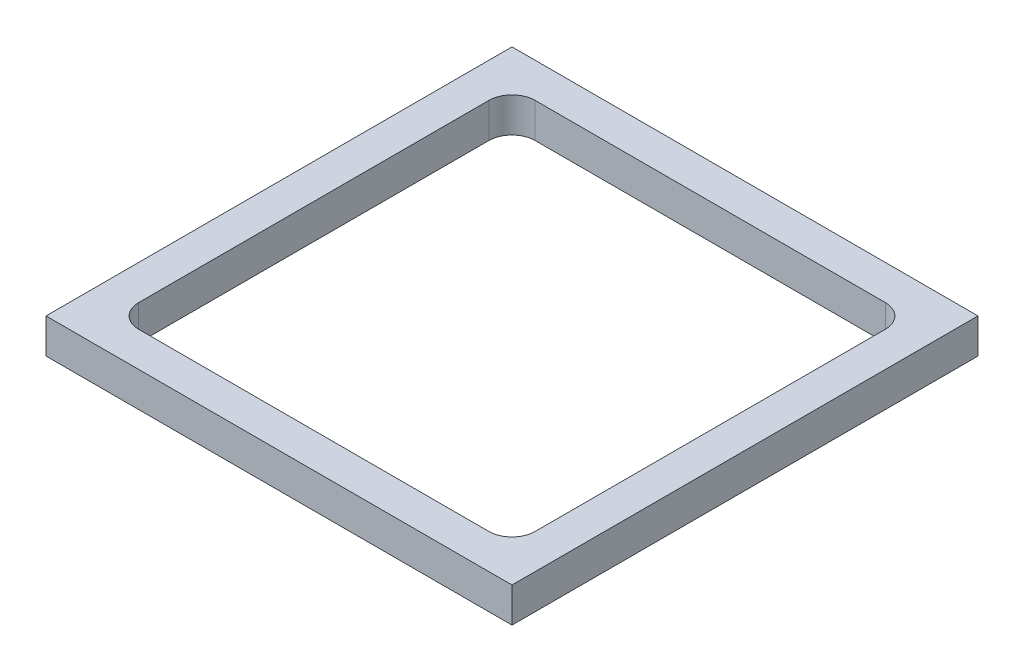
ISO-10303-21;
HEADER;
FILE_DESCRIPTION(('STEP AP214'),'2;1');
FILE_NAME('part.step','',(''),(''),'','','');
FILE_SCHEMA(('AUTOMOTIVE_DESIGN { 1 0 10303 214 1 1 1 1 }'));
ENDSEC;
DATA;
#1=APPLICATION_CONTEXT('core data for automotive mechanical design processes');
#2=APPLICATION_PROTOCOL_DEFINITION('international standard','automotive_design',2000,#1);
#3=PRODUCT_CONTEXT('',#1,'mechanical');
#4=PRODUCT('Part','Part','',(#3));
#5=PRODUCT_RELATED_PRODUCT_CATEGORY('part','',(#4));
#6=PRODUCT_DEFINITION_FORMATION('','',#4);
#7=PRODUCT_DEFINITION_CONTEXT('part definition',#1,'design');
#8=PRODUCT_DEFINITION('design','',#6,#7);
#9=PRODUCT_DEFINITION_SHAPE('','',#8);
#10=(LENGTH_UNIT() NAMED_UNIT(*) SI_UNIT(.MILLI.,.METRE.));
#11=(NAMED_UNIT(*) PLANE_ANGLE_UNIT() SI_UNIT($,.RADIAN.));
#12=(NAMED_UNIT(*) SI_UNIT($,.STERADIAN.) SOLID_ANGLE_UNIT());
#13=UNCERTAINTY_MEASURE_WITH_UNIT(LENGTH_MEASURE(1.E-05),#10,'distance_accuracy_value','');
#14=(GEOMETRIC_REPRESENTATION_CONTEXT(3) GLOBAL_UNCERTAINTY_ASSIGNED_CONTEXT((#13)) GLOBAL_UNIT_ASSIGNED_CONTEXT((#10,
#11,#12)) REPRESENTATION_CONTEXT('',''));
#15=CARTESIAN_POINT('',(0.,0.,0.));
#16=DIRECTION('',(0.,0.,1.));
#17=DIRECTION('',(1.,0.,0.));
#18=AXIS2_PLACEMENT_3D('',#15,#16,#17);
#19=CARTESIAN_POINT('',(0.,9.525,0.));
#20=DIRECTION('',(-1.,0.,0.));
#21=DIRECTION('',(0.,0.,1.));
#22=AXIS2_PLACEMENT_3D('',#19,#20,#21);
#23=PLANE('',#22);
#24=DIRECTION('',(0.,0.,-1.));
#25=VECTOR('',#24,1.);
#26=CARTESIAN_POINT('',(0.,0.,0.));
#27=LINE('',#26,#25);
#28=CARTESIAN_POINT('',(0.,0.,0.));
#29=VERTEX_POINT('',#28);
#30=CARTESIAN_POINT('',(0.,0.,-127.635));
#31=VERTEX_POINT('',#30);
#32=EDGE_CURVE('E160',#29,#31,#27,.T.);
#33=ORIENTED_EDGE('',*,*,#32,.F.);
#34=DIRECTION('',(0.,-1.,0.));
#35=VECTOR('',#34,1.);
#36=CARTESIAN_POINT('',(0.,9.525,0.));
#37=LINE('',#36,#35);
#38=CARTESIAN_POINT('',(0.,9.525,0.));
#39=VERTEX_POINT('',#38);
#40=EDGE_CURVE('E148',#39,#29,#37,.T.);
#41=ORIENTED_EDGE('',*,*,#40,.F.);
#42=DIRECTION('',(0.,0.,-1.));
#43=VECTOR('',#42,1.);
#44=CARTESIAN_POINT('',(0.,9.525,0.));
#45=LINE('',#44,#43);
#46=CARTESIAN_POINT('',(0.,9.525,-127.635));
#47=VERTEX_POINT('',#46);
#48=EDGE_CURVE('E143',#39,#47,#45,.T.);
#49=ORIENTED_EDGE('',*,*,#48,.T.);
#50=DIRECTION('',(0.,-1.,0.));
#51=VECTOR('',#50,1.);
#52=CARTESIAN_POINT('',(0.,9.525,-127.635));
#53=LINE('',#52,#51);
#54=EDGE_CURVE('E127',#47,#31,#53,.T.);
#55=ORIENTED_EDGE('',*,*,#54,.T.);
#56=EDGE_LOOP('',(#33,#41,#49,#55));
#57=FACE_BOUND('',#56,.T.);
#58=ADVANCED_FACE('F37',(#57),#23,.T.);
#59=CARTESIAN_POINT('',(0.,9.525,0.));
#60=DIRECTION('',(0.,0.,-1.));
#61=DIRECTION('',(-1.,0.,0.));
#62=AXIS2_PLACEMENT_3D('',#59,#60,#61);
#63=PLANE('',#62);
#64=DIRECTION('',(1.,0.,0.));
#65=VECTOR('',#64,1.);
#66=CARTESIAN_POINT('',(0.,0.,0.));
#67=LINE('',#66,#65);
#68=CARTESIAN_POINT('',(127.635,0.,0.));
#69=VERTEX_POINT('',#68);
#70=EDGE_CURVE('E150',#29,#69,#67,.T.);
#71=ORIENTED_EDGE('',*,*,#70,.T.);
#72=DIRECTION('',(0.,-1.,0.));
#73=VECTOR('',#72,1.);
#74=CARTESIAN_POINT('',(127.635,9.525,0.));
#75=LINE('',#74,#73);
#76=CARTESIAN_POINT('',(127.635,9.525,0.));
#77=VERTEX_POINT('',#76);
#78=EDGE_CURVE('E168',#77,#69,#75,.T.);
#79=ORIENTED_EDGE('',*,*,#78,.F.);
#80=DIRECTION('',(1.,0.,0.));
#81=VECTOR('',#80,1.);
#82=CARTESIAN_POINT('',(0.,9.525,0.));
#83=LINE('',#82,#81);
#84=EDGE_CURVE('E138',#39,#77,#83,.T.);
#85=ORIENTED_EDGE('',*,*,#84,.F.);
#86=ORIENTED_EDGE('',*,*,#40,.T.);
#87=EDGE_LOOP('',(#71,#79,#85,#86));
#88=FACE_BOUND('',#87,.T.);
#89=ADVANCED_FACE('F251',(#88),#63,.F.);
#90=CARTESIAN_POINT('',(127.635,9.525,0.));
#91=DIRECTION('',(-1.,0.,0.));
#92=DIRECTION('',(0.,0.,1.));
#93=AXIS2_PLACEMENT_3D('',#90,#91,#92);
#94=PLANE('',#93);
#95=DIRECTION('',(0.,0.,-1.));
#96=VECTOR('',#95,1.);
#97=CARTESIAN_POINT('',(127.635,0.,0.));
#98=LINE('',#97,#96);
#99=CARTESIAN_POINT('',(127.635,0.,-127.635));
#100=VERTEX_POINT('',#99);
#101=EDGE_CURVE('E152',#69,#100,#98,.T.);
#102=ORIENTED_EDGE('',*,*,#101,.T.);
#103=DIRECTION('',(0.,-1.,0.));
#104=VECTOR('',#103,1.);
#105=CARTESIAN_POINT('',(127.635,9.525,-127.635));
#106=LINE('',#105,#104);
#107=CARTESIAN_POINT('',(127.635,9.525,-127.635));
#108=VERTEX_POINT('',#107);
#109=EDGE_CURVE('E137',#108,#100,#106,.T.);
#110=ORIENTED_EDGE('',*,*,#109,.F.);
#111=DIRECTION('',(0.,0.,-1.));
#112=VECTOR('',#111,1.);
#113=CARTESIAN_POINT('',(127.635,9.525,0.));
#114=LINE('',#113,#112);
#115=EDGE_CURVE('E145',#77,#108,#114,.T.);
#116=ORIENTED_EDGE('',*,*,#115,.F.);
#117=ORIENTED_EDGE('',*,*,#78,.T.);
#118=EDGE_LOOP('',(#102,#110,#116,#117));
#119=FACE_BOUND('',#118,.T.);
#120=ADVANCED_FACE('F256',(#119),#94,.F.);
#121=CARTESIAN_POINT('',(0.,9.525,-127.635));
#122=DIRECTION('',(0.,0.,-1.));
#123=DIRECTION('',(-1.,0.,0.));
#124=AXIS2_PLACEMENT_3D('',#121,#122,#123);
#125=PLANE('',#124);
#126=DIRECTION('',(1.,0.,0.));
#127=VECTOR('',#126,1.);
#128=CARTESIAN_POINT('',(0.,0.,-127.635));
#129=LINE('',#128,#127);
#130=EDGE_CURVE('E132',#31,#100,#129,.T.);
#131=ORIENTED_EDGE('',*,*,#130,.F.);
#132=ORIENTED_EDGE('',*,*,#54,.F.);
#133=DIRECTION('',(1.,0.,0.));
#134=VECTOR('',#133,1.);
#135=CARTESIAN_POINT('',(0.,9.525,-127.635));
#136=LINE('',#135,#134);
#137=EDGE_CURVE('E130',#47,#108,#136,.T.);
#138=ORIENTED_EDGE('',*,*,#137,.T.);
#139=ORIENTED_EDGE('',*,*,#109,.T.);
#140=EDGE_LOOP('',(#131,#132,#138,#139));
#141=FACE_BOUND('',#140,.T.);
#142=ADVANCED_FACE('F129',(#141),#125,.T.);
#143=CARTESIAN_POINT('',(0.,9.525,0.));
#144=DIRECTION('',(0.,-1.,0.));
#145=DIRECTION('',(0.,0.,-1.));
#146=AXIS2_PLACEMENT_3D('',#143,#144,#145);
#147=PLANE('',#146);
#148=DIRECTION('',(1.,0.,0.));
#149=VECTOR('',#148,1.);
#150=CARTESIAN_POINT('',(9.52499999999999,9.525,-118.11));
#151=LINE('',#150,#149);
#152=CARTESIAN_POINT('',(15.875,9.525,-118.11));
#153=VERTEX_POINT('',#152);
#154=CARTESIAN_POINT('',(111.76,9.525,-118.11));
#155=VERTEX_POINT('',#154);
#156=EDGE_CURVE('E211',#153,#155,#151,.T.);
#157=ORIENTED_EDGE('',*,*,#156,.T.);
#158=CARTESIAN_POINT('',(111.76,9.525,-111.76));
#159=DIRECTION('',(0.,-1.,0.));
#160=DIRECTION('',(0.,0.,-1.));
#161=AXIS2_PLACEMENT_3D('',#158,#159,#160);
#162=CIRCLE('',#161,6.35);
#163=CARTESIAN_POINT('',(118.11,9.525,-111.76));
#164=VERTEX_POINT('',#163);
#165=EDGE_CURVE('E194',#155,#164,#162,.T.);
#166=ORIENTED_EDGE('',*,*,#165,.T.);
#167=DIRECTION('',(0.,0.,1.));
#168=VECTOR('',#167,1.);
#169=CARTESIAN_POINT('',(118.11,9.525,-118.11));
#170=LINE('',#169,#168);
#171=CARTESIAN_POINT('',(118.11,9.525,-15.875));
#172=VERTEX_POINT('',#171);
#173=EDGE_CURVE('E231',#164,#172,#170,.T.);
#174=ORIENTED_EDGE('',*,*,#173,.T.);
#175=CARTESIAN_POINT('',(111.76,9.525,-15.875));
#176=DIRECTION('',(0.,-1.,0.));
#177=DIRECTION('',(0.,0.,-1.));
#178=AXIS2_PLACEMENT_3D('',#175,#176,#177);
#179=CIRCLE('',#178,6.35);
#180=CARTESIAN_POINT('',(111.76,9.525,-9.52500000000001));
#181=VERTEX_POINT('',#180);
#182=EDGE_CURVE('E190',#172,#181,#179,.T.);
#183=ORIENTED_EDGE('',*,*,#182,.T.);
#184=DIRECTION('',(1.,0.,0.));
#185=VECTOR('',#184,1.);
#186=CARTESIAN_POINT('',(9.52500000000001,9.525,-9.52500000000001));
#187=LINE('',#186,#185);
#188=CARTESIAN_POINT('',(15.875,9.525,-9.52500000000001));
#189=VERTEX_POINT('',#188);
#190=EDGE_CURVE('E205',#189,#181,#187,.T.);
#191=ORIENTED_EDGE('',*,*,#190,.F.);
#192=CARTESIAN_POINT('',(15.875,9.525,-15.875));
#193=DIRECTION('',(0.,-1.,0.));
#194=DIRECTION('',(0.,0.,-1.));
#195=AXIS2_PLACEMENT_3D('',#192,#193,#194);
#196=CIRCLE('',#195,6.35);
#197=CARTESIAN_POINT('',(9.52500000000001,9.525,-15.875));
#198=VERTEX_POINT('',#197);
#199=EDGE_CURVE('E45',#189,#198,#196,.T.);
#200=ORIENTED_EDGE('',*,*,#199,.T.);
#201=DIRECTION('',(0.,0.,1.));
#202=VECTOR('',#201,1.);
#203=CARTESIAN_POINT('',(9.52499999999999,9.525,-118.11));
#204=LINE('',#203,#202);
#205=CARTESIAN_POINT('',(9.52499999999999,9.525,-111.76));
#206=VERTEX_POINT('',#205);
#207=EDGE_CURVE('E155',#206,#198,#204,.T.);
#208=ORIENTED_EDGE('',*,*,#207,.F.);
#209=CARTESIAN_POINT('',(15.875,9.525,-111.76));
#210=DIRECTION('',(0.,-1.,0.));
#211=DIRECTION('',(0.,0.,-1.));
#212=AXIS2_PLACEMENT_3D('',#209,#210,#211);
#213=CIRCLE('',#212,6.35);
#214=EDGE_CURVE('E198',#206,#153,#213,.T.);
#215=ORIENTED_EDGE('',*,*,#214,.T.);
#216=EDGE_LOOP('',(#157,#166,#174,#183,#191,#200,#208,#215));
#217=FACE_BOUND('',#216,.T.);
#218=ORIENTED_EDGE('',*,*,#48,.F.);
#219=ORIENTED_EDGE('',*,*,#84,.T.);
#220=ORIENTED_EDGE('',*,*,#115,.T.);
#221=ORIENTED_EDGE('',*,*,#137,.F.);
#222=EDGE_LOOP('',(#218,#219,#220,#221));
#223=FACE_BOUND('',#222,.T.);
#224=ADVANCED_FACE('F142',(#217,#223),#147,.F.);
#225=CARTESIAN_POINT('',(0.,0.,0.));
#226=DIRECTION('',(0.,-1.,0.));
#227=DIRECTION('',(0.,0.,-1.));
#228=AXIS2_PLACEMENT_3D('',#225,#226,#227);
#229=PLANE('',#228);
#230=DIRECTION('',(0.,0.,1.));
#231=VECTOR('',#230,1.);
#232=CARTESIAN_POINT('',(9.52499999999999,0.,-118.11));
#233=LINE('',#232,#231);
#234=CARTESIAN_POINT('',(9.52499999999999,0.,-111.76));
#235=VERTEX_POINT('',#234);
#236=CARTESIAN_POINT('',(9.52500000000001,0.,-15.875));
#237=VERTEX_POINT('',#236);
#238=EDGE_CURVE('E162',#235,#237,#233,.T.);
#239=ORIENTED_EDGE('',*,*,#238,.T.);
#240=CARTESIAN_POINT('',(15.875,0.,-15.875));
#241=DIRECTION('',(0.,-1.,0.));
#242=DIRECTION('',(0.,0.,-1.));
#243=AXIS2_PLACEMENT_3D('',#240,#241,#242);
#244=CIRCLE('',#243,6.35);
#245=CARTESIAN_POINT('',(15.875,0.,-9.52500000000001));
#246=VERTEX_POINT('',#245);
#247=EDGE_CURVE('E11',#237,#246,#244,.F.);
#248=ORIENTED_EDGE('',*,*,#247,.T.);
#249=DIRECTION('',(1.,0.,0.));
#250=VECTOR('',#249,1.);
#251=CARTESIAN_POINT('',(9.52500000000001,0.,-9.52500000000001));
#252=LINE('',#251,#250);
#253=CARTESIAN_POINT('',(111.76,0.,-9.52500000000001));
#254=VERTEX_POINT('',#253);
#255=EDGE_CURVE('E210',#246,#254,#252,.T.);
#256=ORIENTED_EDGE('',*,*,#255,.T.);
#257=CARTESIAN_POINT('',(111.76,0.,-15.875));
#258=DIRECTION('',(0.,-1.,0.));
#259=DIRECTION('',(0.,0.,-1.));
#260=AXIS2_PLACEMENT_3D('',#257,#258,#259);
#261=CIRCLE('',#260,6.35);
#262=CARTESIAN_POINT('',(118.11,0.,-15.875));
#263=VERTEX_POINT('',#262);
#264=EDGE_CURVE('E192',#254,#263,#261,.F.);
#265=ORIENTED_EDGE('',*,*,#264,.T.);
#266=DIRECTION('',(0.,0.,1.));
#267=VECTOR('',#266,1.);
#268=CARTESIAN_POINT('',(118.11,0.,-118.11));
#269=LINE('',#268,#267);
#270=CARTESIAN_POINT('',(118.11,0.,-111.76));
#271=VERTEX_POINT('',#270);
#272=EDGE_CURVE('E221',#271,#263,#269,.T.);
#273=ORIENTED_EDGE('',*,*,#272,.F.);
#274=CARTESIAN_POINT('',(111.76,0.,-111.76));
#275=DIRECTION('',(0.,-1.,0.));
#276=DIRECTION('',(0.,0.,-1.));
#277=AXIS2_PLACEMENT_3D('',#274,#275,#276);
#278=CIRCLE('',#277,6.35);
#279=CARTESIAN_POINT('',(111.76,0.,-118.11));
#280=VERTEX_POINT('',#279);
#281=EDGE_CURVE('E196',#271,#280,#278,.F.);
#282=ORIENTED_EDGE('',*,*,#281,.T.);
#283=DIRECTION('',(1.,0.,0.));
#284=VECTOR('',#283,1.);
#285=CARTESIAN_POINT('',(9.52499999999999,0.,-118.11));
#286=LINE('',#285,#284);
#287=CARTESIAN_POINT('',(15.875,0.,-118.11));
#288=VERTEX_POINT('',#287);
#289=EDGE_CURVE('E224',#288,#280,#286,.T.);
#290=ORIENTED_EDGE('',*,*,#289,.F.);
#291=CARTESIAN_POINT('',(15.875,0.,-111.76));
#292=DIRECTION('',(0.,-1.,0.));
#293=DIRECTION('',(0.,0.,-1.));
#294=AXIS2_PLACEMENT_3D('',#291,#292,#293);
#295=CIRCLE('',#294,6.35);
#296=EDGE_CURVE('E59',#288,#235,#295,.F.);
#297=ORIENTED_EDGE('',*,*,#296,.T.);
#298=EDGE_LOOP('',(#239,#248,#256,#265,#273,#282,#290,#297));
#299=FACE_BOUND('',#298,.T.);
#300=ORIENTED_EDGE('',*,*,#32,.T.);
#301=ORIENTED_EDGE('',*,*,#130,.T.);
#302=ORIENTED_EDGE('',*,*,#101,.F.);
#303=ORIENTED_EDGE('',*,*,#70,.F.);
#304=EDGE_LOOP('',(#300,#301,#302,#303));
#305=FACE_BOUND('',#304,.T.);
#306=ADVANCED_FACE('F215',(#299,#305),#229,.T.);
#307=CARTESIAN_POINT('',(9.52500000000001,0.,-9.52500000000001));
#308=DIRECTION('',(0.,0.,1.));
#309=DIRECTION('',(1.,0.,0.));
#310=AXIS2_PLACEMENT_3D('',#307,#308,#309);
#311=PLANE('',#310);
#312=ORIENTED_EDGE('',*,*,#190,.T.);
#313=DIRECTION('',(0.,1.,0.));
#314=VECTOR('',#313,1.);
#315=CARTESIAN_POINT('',(111.76,0.,-9.52500000000001));
#316=LINE('',#315,#314);
#317=EDGE_CURVE('E179',#181,#254,#316,.F.);
#318=ORIENTED_EDGE('',*,*,#317,.T.);
#319=ORIENTED_EDGE('',*,*,#255,.F.);
#320=DIRECTION('',(0.,1.,0.));
#321=VECTOR('',#320,1.);
#322=CARTESIAN_POINT('',(15.875,9.525,-9.52500000000001));
#323=LINE('',#322,#321);
#324=EDGE_CURVE('E176',#246,#189,#323,.T.);
#325=ORIENTED_EDGE('',*,*,#324,.T.);
#326=EDGE_LOOP('',(#312,#318,#319,#325));
#327=FACE_BOUND('',#326,.T.);
#328=ADVANCED_FACE('F219',(#327),#311,.F.);
#329=CARTESIAN_POINT('',(9.52499999999999,0.,-118.11));
#330=DIRECTION('',(-1.,0.,0.));
#331=DIRECTION('',(0.,0.,1.));
#332=AXIS2_PLACEMENT_3D('',#329,#330,#331);
#333=PLANE('',#332);
#334=ORIENTED_EDGE('',*,*,#238,.F.);
#335=DIRECTION('',(0.,1.,0.));
#336=VECTOR('',#335,1.);
#337=CARTESIAN_POINT('',(9.52499999999999,0.,-111.76));
#338=LINE('',#337,#336);
#339=EDGE_CURVE('E187',#235,#206,#338,.T.);
#340=ORIENTED_EDGE('',*,*,#339,.T.);
#341=ORIENTED_EDGE('',*,*,#207,.T.);
#342=DIRECTION('',(0.,1.,0.));
#343=VECTOR('',#342,1.);
#344=CARTESIAN_POINT('',(9.52500000000001,0.,-15.875));
#345=LINE('',#344,#343);
#346=EDGE_CURVE('E52',#198,#237,#345,.F.);
#347=ORIENTED_EDGE('',*,*,#346,.T.);
#348=EDGE_LOOP('',(#334,#340,#341,#347));
#349=FACE_BOUND('',#348,.T.);
#350=ADVANCED_FACE('F208',(#349),#333,.F.);
#351=CARTESIAN_POINT('',(9.52499999999999,0.,-118.11));
#352=DIRECTION('',(0.,0.,1.));
#353=DIRECTION('',(1.,0.,0.));
#354=AXIS2_PLACEMENT_3D('',#351,#352,#353);
#355=PLANE('',#354);
#356=ORIENTED_EDGE('',*,*,#289,.T.);
#357=DIRECTION('',(0.,1.,0.));
#358=VECTOR('',#357,1.);
#359=CARTESIAN_POINT('',(111.76,9.525,-118.11));
#360=LINE('',#359,#358);
#361=EDGE_CURVE('E183',#280,#155,#360,.T.);
#362=ORIENTED_EDGE('',*,*,#361,.T.);
#363=ORIENTED_EDGE('',*,*,#156,.F.);
#364=DIRECTION('',(0.,1.,0.));
#365=VECTOR('',#364,1.);
#366=CARTESIAN_POINT('',(15.875,0.,-118.11));
#367=LINE('',#366,#365);
#368=EDGE_CURVE('E181',#153,#288,#367,.F.);
#369=ORIENTED_EDGE('',*,*,#368,.T.);
#370=EDGE_LOOP('',(#356,#362,#363,#369));
#371=FACE_BOUND('',#370,.T.);
#372=ADVANCED_FACE('F237',(#371),#355,.T.);
#373=CARTESIAN_POINT('',(118.11,0.,-118.11));
#374=DIRECTION('',(-1.,0.,0.));
#375=DIRECTION('',(0.,0.,1.));
#376=AXIS2_PLACEMENT_3D('',#373,#374,#375);
#377=PLANE('',#376);
#378=ORIENTED_EDGE('',*,*,#272,.T.);
#379=DIRECTION('',(0.,1.,0.));
#380=VECTOR('',#379,1.);
#381=CARTESIAN_POINT('',(118.11,0.,-15.875));
#382=LINE('',#381,#380);
#383=EDGE_CURVE('E173',#263,#172,#382,.T.);
#384=ORIENTED_EDGE('',*,*,#383,.T.);
#385=ORIENTED_EDGE('',*,*,#173,.F.);
#386=DIRECTION('',(0.,1.,0.));
#387=VECTOR('',#386,1.);
#388=CARTESIAN_POINT('',(118.11,0.,-111.76));
#389=LINE('',#388,#387);
#390=EDGE_CURVE('E167',#164,#271,#389,.F.);
#391=ORIENTED_EDGE('',*,*,#390,.T.);
#392=EDGE_LOOP('',(#378,#384,#385,#391));
#393=FACE_BOUND('',#392,.T.);
#394=ADVANCED_FACE('F263',(#393),#377,.T.);
#395=CARTESIAN_POINT('',(111.76,0.,-15.875));
#396=DIRECTION('',(0.,1.,0.));
#397=DIRECTION('',(0.,0.,1.));
#398=AXIS2_PLACEMENT_3D('',#395,#396,#397);
#399=CYLINDRICAL_SURFACE('',#398,6.35);
#400=ORIENTED_EDGE('',*,*,#264,.F.);
#401=ORIENTED_EDGE('',*,*,#317,.F.);
#402=ORIENTED_EDGE('',*,*,#182,.F.);
#403=ORIENTED_EDGE('',*,*,#383,.F.);
#404=EDGE_LOOP('',(#400,#401,#402,#403));
#405=FACE_BOUND('',#404,.T.);
#406=ADVANCED_FACE('F247',(#405),#399,.F.);
#407=CARTESIAN_POINT('',(111.76,0.,-111.76));
#408=DIRECTION('',(0.,-1.,0.));
#409=DIRECTION('',(0.,0.,-1.));
#410=AXIS2_PLACEMENT_3D('',#407,#408,#409);
#411=CYLINDRICAL_SURFACE('',#410,6.35);
#412=ORIENTED_EDGE('',*,*,#281,.F.);
#413=ORIENTED_EDGE('',*,*,#390,.F.);
#414=ORIENTED_EDGE('',*,*,#165,.F.);
#415=ORIENTED_EDGE('',*,*,#361,.F.);
#416=EDGE_LOOP('',(#412,#413,#414,#415));
#417=FACE_BOUND('',#416,.T.);
#418=ADVANCED_FACE('F242',(#417),#411,.F.);
#419=CARTESIAN_POINT('',(15.875,0.,-111.76));
#420=DIRECTION('',(0.,1.,0.));
#421=DIRECTION('',(0.,0.,1.));
#422=AXIS2_PLACEMENT_3D('',#419,#420,#421);
#423=CYLINDRICAL_SURFACE('',#422,6.35);
#424=ORIENTED_EDGE('',*,*,#296,.F.);
#425=ORIENTED_EDGE('',*,*,#368,.F.);
#426=ORIENTED_EDGE('',*,*,#214,.F.);
#427=ORIENTED_EDGE('',*,*,#339,.F.);
#428=EDGE_LOOP('',(#424,#425,#426,#427));
#429=FACE_BOUND('',#428,.T.);
#430=ADVANCED_FACE('F240',(#429),#423,.F.);
#431=CARTESIAN_POINT('',(15.875,0.,-15.875));
#432=DIRECTION('',(0.,-1.,0.));
#433=DIRECTION('',(0.,0.,-1.));
#434=AXIS2_PLACEMENT_3D('',#431,#432,#433);
#435=CYLINDRICAL_SURFACE('',#434,6.35);
#436=ORIENTED_EDGE('',*,*,#247,.F.);
#437=ORIENTED_EDGE('',*,*,#346,.F.);
#438=ORIENTED_EDGE('',*,*,#199,.F.);
#439=ORIENTED_EDGE('',*,*,#324,.F.);
#440=EDGE_LOOP('',(#436,#437,#438,#439));
#441=FACE_BOUND('',#440,.T.);
#442=ADVANCED_FACE('F39',(#441),#435,.F.);
#443=CLOSED_SHELL('',(#58,#89,#120,#142,#224,#306,#328,#350,#372,#394,#406,#418,#430,#442));
#444=MANIFOLD_SOLID_BREP('B2',#443);
#445=ADVANCED_BREP_SHAPE_REPRESENTATION('',(#18,#444),#14);
#446=SHAPE_DEFINITION_REPRESENTATION(#9,#445);
ENDSEC;
END-ISO-10303-21;
